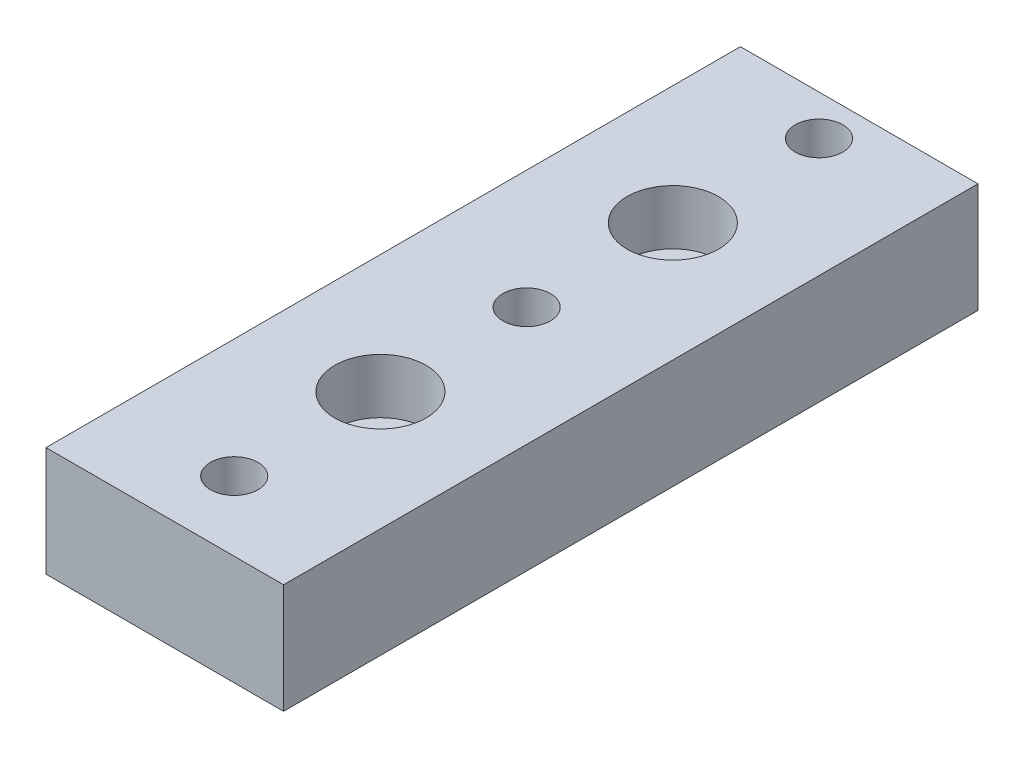
ISO-10303-21;
HEADER;
FILE_DESCRIPTION(('STEP AP214'),'2;1');
FILE_NAME('part.step','',(''),(''),'','','');
FILE_SCHEMA(('AUTOMOTIVE_DESIGN { 1 0 10303 214 1 1 1 1 }'));
ENDSEC;
DATA;
#1=APPLICATION_CONTEXT('core data for automotive mechanical design processes');
#2=APPLICATION_PROTOCOL_DEFINITION('international standard','automotive_design',2000,#1);
#3=PRODUCT_CONTEXT('',#1,'mechanical');
#4=PRODUCT('Part','Part','',(#3));
#5=PRODUCT_RELATED_PRODUCT_CATEGORY('part','',(#4));
#6=PRODUCT_DEFINITION_FORMATION('','',#4);
#7=PRODUCT_DEFINITION_CONTEXT('part definition',#1,'design');
#8=PRODUCT_DEFINITION('design','',#6,#7);
#9=PRODUCT_DEFINITION_SHAPE('','',#8);
#10=(LENGTH_UNIT() NAMED_UNIT(*) SI_UNIT(.MILLI.,.METRE.));
#11=(NAMED_UNIT(*) PLANE_ANGLE_UNIT() SI_UNIT($,.RADIAN.));
#12=(NAMED_UNIT(*) SI_UNIT($,.STERADIAN.) SOLID_ANGLE_UNIT());
#13=UNCERTAINTY_MEASURE_WITH_UNIT(LENGTH_MEASURE(1.E-05),#10,'distance_accuracy_value','');
#14=(GEOMETRIC_REPRESENTATION_CONTEXT(3) GLOBAL_UNCERTAINTY_ASSIGNED_CONTEXT((#13)) GLOBAL_UNIT_ASSIGNED_CONTEXT((#10,
#11,#12)) REPRESENTATION_CONTEXT('',''));
#15=CARTESIAN_POINT('',(0.,0.,0.));
#16=DIRECTION('',(0.,0.,1.));
#17=DIRECTION('',(1.,0.,0.));
#18=AXIS2_PLACEMENT_3D('',#15,#16,#17);
#19=CARTESIAN_POINT('',(0.,-3.,-4.4));
#20=DIRECTION('',(0.,1.,0.));
#21=DIRECTION('',(0.,0.,1.));
#22=AXIS2_PLACEMENT_3D('',#19,#20,#21);
#23=CYLINDRICAL_SURFACE('',#22,0.65);
#24=CARTESIAN_POINT('',(0.,-3.,-4.4));
#25=DIRECTION('',(0.,1.,0.));
#26=DIRECTION('',(0.,0.,1.));
#27=AXIS2_PLACEMENT_3D('',#24,#25,#26);
#28=CIRCLE('',#27,0.65);
#29=CARTESIAN_POINT('',(0.,-3.,-3.75));
#30=VERTEX_POINT('',#29);
#31=EDGE_CURVE('E144',#30,#30,#28,.T.);
#32=ORIENTED_EDGE('',*,*,#31,.F.);
#33=EDGE_LOOP('',(#32));
#34=FACE_BOUND('',#33,.T.);
#35=CARTESIAN_POINT('',(0.,-1.5,-4.4));
#36=DIRECTION('',(0.,1.,0.));
#37=DIRECTION('',(0.,0.,1.));
#38=AXIS2_PLACEMENT_3D('',#35,#36,#37);
#39=CIRCLE('',#38,0.65);
#40=CARTESIAN_POINT('',(0.,-1.5,-3.75));
#41=VERTEX_POINT('',#40);
#42=EDGE_CURVE('E43',#41,#41,#39,.F.);
#43=ORIENTED_EDGE('',*,*,#42,.F.);
#44=EDGE_LOOP('',(#43));
#45=FACE_BOUND('',#44,.T.);
#46=ADVANCED_FACE('F39',(#34,#45),#23,.F.);
#47=CARTESIAN_POINT('',(0.,-3.,3.6));
#48=DIRECTION('',(0.,1.,0.));
#49=DIRECTION('',(0.,0.,1.));
#50=AXIS2_PLACEMENT_3D('',#47,#48,#49);
#51=CYLINDRICAL_SURFACE('',#50,0.65);
#52=CARTESIAN_POINT('',(0.,-3.,3.6));
#53=DIRECTION('',(0.,1.,0.));
#54=DIRECTION('',(0.,0.,1.));
#55=AXIS2_PLACEMENT_3D('',#52,#53,#54);
#56=CIRCLE('',#55,0.65);
#57=CARTESIAN_POINT('',(0.,-3.,4.25));
#58=VERTEX_POINT('',#57);
#59=EDGE_CURVE('E123',#58,#58,#56,.T.);
#60=ORIENTED_EDGE('',*,*,#59,.F.);
#61=EDGE_LOOP('',(#60));
#62=FACE_BOUND('',#61,.T.);
#63=CARTESIAN_POINT('',(0.,-1.5,3.6));
#64=DIRECTION('',(0.,1.,0.));
#65=DIRECTION('',(0.,0.,1.));
#66=AXIS2_PLACEMENT_3D('',#63,#64,#65);
#67=CIRCLE('',#66,0.65);
#68=CARTESIAN_POINT('',(0.,-1.5,4.25));
#69=VERTEX_POINT('',#68);
#70=EDGE_CURVE('E117',#69,#69,#67,.F.);
#71=ORIENTED_EDGE('',*,*,#70,.F.);
#72=EDGE_LOOP('',(#71));
#73=FACE_BOUND('',#72,.T.);
#74=ADVANCED_FACE('F185',(#62,#73),#51,.F.);
#75=CARTESIAN_POINT('',(-3.25,-3.,9.5));
#76=DIRECTION('',(0.,0.,1.));
#77=DIRECTION('',(1.,0.,0.));
#78=AXIS2_PLACEMENT_3D('',#75,#76,#77);
#79=PLANE('',#78);
#80=DIRECTION('',(1.,0.,0.));
#81=VECTOR('',#80,1.);
#82=CARTESIAN_POINT('',(-3.25,0.,9.5));
#83=LINE('',#82,#81);
#84=CARTESIAN_POINT('',(-3.25,0.,9.5));
#85=VERTEX_POINT('',#84);
#86=CARTESIAN_POINT('',(3.25,0.,9.5));
#87=VERTEX_POINT('',#86);
#88=EDGE_CURVE('E107',#85,#87,#83,.T.);
#89=ORIENTED_EDGE('',*,*,#88,.F.);
#90=DIRECTION('',(0.,1.,0.));
#91=VECTOR('',#90,1.);
#92=CARTESIAN_POINT('',(-3.25,-3.,9.5));
#93=LINE('',#92,#91);
#94=CARTESIAN_POINT('',(-3.25,-3.,9.5));
#95=VERTEX_POINT('',#94);
#96=EDGE_CURVE('E11',#95,#85,#93,.T.);
#97=ORIENTED_EDGE('',*,*,#96,.F.);
#98=DIRECTION('',(1.,0.,0.));
#99=VECTOR('',#98,1.);
#100=CARTESIAN_POINT('',(-3.25,-3.,9.5));
#101=LINE('',#100,#99);
#102=CARTESIAN_POINT('',(3.25,-3.,9.5));
#103=VERTEX_POINT('',#102);
#104=EDGE_CURVE('E100',#95,#103,#101,.T.);
#105=ORIENTED_EDGE('',*,*,#104,.T.);
#106=DIRECTION('',(0.,1.,0.));
#107=VECTOR('',#106,1.);
#108=CARTESIAN_POINT('',(3.25,-3.,9.5));
#109=LINE('',#108,#107);
#110=EDGE_CURVE('E83',#103,#87,#109,.T.);
#111=ORIENTED_EDGE('',*,*,#110,.T.);
#112=EDGE_LOOP('',(#89,#97,#105,#111));
#113=FACE_BOUND('',#112,.T.);
#114=ADVANCED_FACE('F41',(#113),#79,.T.);
#115=CARTESIAN_POINT('',(-3.25,-3.,9.5));
#116=DIRECTION('',(-1.,0.,0.));
#117=DIRECTION('',(0.,0.,1.));
#118=AXIS2_PLACEMENT_3D('',#115,#116,#117);
#119=PLANE('',#118);
#120=DIRECTION('',(0.,0.,1.));
#121=VECTOR('',#120,1.);
#122=CARTESIAN_POINT('',(-3.25,0.,9.5));
#123=LINE('',#122,#121);
#124=CARTESIAN_POINT('',(-3.25,0.,-9.5));
#125=VERTEX_POINT('',#124);
#126=EDGE_CURVE('E102',#125,#85,#123,.T.);
#127=ORIENTED_EDGE('',*,*,#126,.F.);
#128=DIRECTION('',(0.,1.,0.));
#129=VECTOR('',#128,1.);
#130=CARTESIAN_POINT('',(-3.25,-3.,-9.5));
#131=LINE('',#130,#129);
#132=CARTESIAN_POINT('',(-3.25,-3.,-9.5));
#133=VERTEX_POINT('',#132);
#134=EDGE_CURVE('E49',#133,#125,#131,.T.);
#135=ORIENTED_EDGE('',*,*,#134,.F.);
#136=DIRECTION('',(0.,0.,1.));
#137=VECTOR('',#136,1.);
#138=CARTESIAN_POINT('',(-3.25,-3.,9.5));
#139=LINE('',#138,#137);
#140=EDGE_CURVE('E97',#133,#95,#139,.T.);
#141=ORIENTED_EDGE('',*,*,#140,.T.);
#142=ORIENTED_EDGE('',*,*,#96,.T.);
#143=EDGE_LOOP('',(#127,#135,#141,#142));
#144=FACE_BOUND('',#143,.T.);
#145=ADVANCED_FACE('F177',(#144),#119,.T.);
#146=CARTESIAN_POINT('',(-3.25,-3.,-9.5));
#147=DIRECTION('',(0.,0.,-1.));
#148=DIRECTION('',(-1.,0.,0.));
#149=AXIS2_PLACEMENT_3D('',#146,#147,#148);
#150=PLANE('',#149);
#151=DIRECTION('',(-1.,0.,0.));
#152=VECTOR('',#151,1.);
#153=CARTESIAN_POINT('',(-3.25,0.,-9.5));
#154=LINE('',#153,#152);
#155=CARTESIAN_POINT('',(3.25,0.,-9.5));
#156=VERTEX_POINT('',#155);
#157=EDGE_CURVE('E91',#156,#125,#154,.T.);
#158=ORIENTED_EDGE('',*,*,#157,.F.);
#159=DIRECTION('',(0.,1.,0.));
#160=VECTOR('',#159,1.);
#161=CARTESIAN_POINT('',(3.25,-3.,-9.5));
#162=LINE('',#161,#160);
#163=CARTESIAN_POINT('',(3.25,-3.,-9.5));
#164=VERTEX_POINT('',#163);
#165=EDGE_CURVE('E86',#164,#156,#162,.T.);
#166=ORIENTED_EDGE('',*,*,#165,.F.);
#167=DIRECTION('',(-1.,0.,0.));
#168=VECTOR('',#167,1.);
#169=CARTESIAN_POINT('',(-3.25,-3.,-9.5));
#170=LINE('',#169,#168);
#171=EDGE_CURVE('E89',#164,#133,#170,.T.);
#172=ORIENTED_EDGE('',*,*,#171,.T.);
#173=ORIENTED_EDGE('',*,*,#134,.T.);
#174=EDGE_LOOP('',(#158,#166,#172,#173));
#175=FACE_BOUND('',#174,.T.);
#176=ADVANCED_FACE('F88',(#175),#150,.T.);
#177=CARTESIAN_POINT('',(3.25,-3.,9.5));
#178=DIRECTION('',(1.,0.,0.));
#179=DIRECTION('',(0.,0.,-1.));
#180=AXIS2_PLACEMENT_3D('',#177,#178,#179);
#181=PLANE('',#180);
#182=DIRECTION('',(0.,0.,-1.));
#183=VECTOR('',#182,1.);
#184=CARTESIAN_POINT('',(3.25,0.,9.5));
#185=LINE('',#184,#183);
#186=EDGE_CURVE('E110',#87,#156,#185,.T.);
#187=ORIENTED_EDGE('',*,*,#186,.F.);
#188=ORIENTED_EDGE('',*,*,#110,.F.);
#189=DIRECTION('',(0.,0.,-1.));
#190=VECTOR('',#189,1.);
#191=CARTESIAN_POINT('',(3.25,-3.,9.5));
#192=LINE('',#191,#190);
#193=EDGE_CURVE('E96',#103,#164,#192,.T.);
#194=ORIENTED_EDGE('',*,*,#193,.T.);
#195=ORIENTED_EDGE('',*,*,#165,.T.);
#196=EDGE_LOOP('',(#187,#188,#194,#195));
#197=FACE_BOUND('',#196,.T.);
#198=ADVANCED_FACE('F99',(#197),#181,.T.);
#199=CARTESIAN_POINT('',(0.,-3.,0.));
#200=DIRECTION('',(0.,1.,0.));
#201=DIRECTION('',(0.,0.,1.));
#202=AXIS2_PLACEMENT_3D('',#199,#200,#201);
#203=PLANE('',#202);
#204=CARTESIAN_POINT('',(0.,-3.,7.6));
#205=DIRECTION('',(0.,1.,0.));
#206=DIRECTION('',(0.,0.,1.));
#207=AXIS2_PLACEMENT_3D('',#204,#205,#206);
#208=CIRCLE('',#207,0.65);
#209=CARTESIAN_POINT('',(0.,-3.,8.25));
#210=VERTEX_POINT('',#209);
#211=EDGE_CURVE('E111',#210,#210,#208,.T.);
#212=ORIENTED_EDGE('',*,*,#211,.T.);
#213=EDGE_LOOP('',(#212));
#214=FACE_BOUND('',#213,.T.);
#215=ORIENTED_EDGE('',*,*,#59,.T.);
#216=EDGE_LOOP('',(#215));
#217=FACE_BOUND('',#216,.T.);
#218=ORIENTED_EDGE('',*,*,#31,.T.);
#219=EDGE_LOOP('',(#218));
#220=FACE_BOUND('',#219,.T.);
#221=CARTESIAN_POINT('',(0.,-3.,-8.4));
#222=DIRECTION('',(0.,1.,0.));
#223=DIRECTION('',(0.,0.,1.));
#224=AXIS2_PLACEMENT_3D('',#221,#222,#223);
#225=CIRCLE('',#224,0.65);
#226=CARTESIAN_POINT('',(0.,-3.,-7.75));
#227=VERTEX_POINT('',#226);
#228=EDGE_CURVE('E147',#227,#227,#225,.T.);
#229=ORIENTED_EDGE('',*,*,#228,.T.);
#230=EDGE_LOOP('',(#229));
#231=FACE_BOUND('',#230,.T.);
#232=CARTESIAN_POINT('',(0.,-3.,-0.4));
#233=DIRECTION('',(0.,1.,0.));
#234=DIRECTION('',(0.,0.,1.));
#235=AXIS2_PLACEMENT_3D('',#232,#233,#234);
#236=CIRCLE('',#235,0.65);
#237=CARTESIAN_POINT('',(0.,-3.,0.25));
#238=VERTEX_POINT('',#237);
#239=EDGE_CURVE('E152',#238,#238,#236,.T.);
#240=ORIENTED_EDGE('',*,*,#239,.T.);
#241=EDGE_LOOP('',(#240));
#242=FACE_BOUND('',#241,.T.);
#243=ORIENTED_EDGE('',*,*,#104,.F.);
#244=ORIENTED_EDGE('',*,*,#140,.F.);
#245=ORIENTED_EDGE('',*,*,#171,.F.);
#246=ORIENTED_EDGE('',*,*,#193,.F.);
#247=EDGE_LOOP('',(#243,#244,#245,#246));
#248=FACE_BOUND('',#247,.T.);
#249=ADVANCED_FACE('F95',(#214,#217,#220,#231,#242,#248),#203,.F.);
#250=CARTESIAN_POINT('',(0.,0.,0.));
#251=DIRECTION('',(0.,1.,0.));
#252=DIRECTION('',(0.,0.,1.));
#253=AXIS2_PLACEMENT_3D('',#250,#251,#252);
#254=PLANE('',#253);
#255=CARTESIAN_POINT('',(0.,0.,-4.4));
#256=DIRECTION('',(0.,1.,0.));
#257=DIRECTION('',(0.,0.,1.));
#258=AXIS2_PLACEMENT_3D('',#255,#256,#257);
#259=CIRCLE('',#258,1.25);
#260=CARTESIAN_POINT('',(0.,0.,-3.15));
#261=VERTEX_POINT('',#260);
#262=EDGE_CURVE('E125',#261,#261,#259,.T.);
#263=ORIENTED_EDGE('',*,*,#262,.F.);
#264=EDGE_LOOP('',(#263));
#265=FACE_BOUND('',#264,.T.);
#266=CARTESIAN_POINT('',(0.,0.,3.6));
#267=DIRECTION('',(0.,1.,0.));
#268=DIRECTION('',(0.,0.,1.));
#269=AXIS2_PLACEMENT_3D('',#266,#267,#268);
#270=CIRCLE('',#269,1.25);
#271=CARTESIAN_POINT('',(0.,0.,4.85));
#272=VERTEX_POINT('',#271);
#273=EDGE_CURVE('E130',#272,#272,#270,.T.);
#274=ORIENTED_EDGE('',*,*,#273,.F.);
#275=EDGE_LOOP('',(#274));
#276=FACE_BOUND('',#275,.T.);
#277=CARTESIAN_POINT('',(0.,0.,7.6));
#278=DIRECTION('',(0.,1.,0.));
#279=DIRECTION('',(0.,0.,1.));
#280=AXIS2_PLACEMENT_3D('',#277,#278,#279);
#281=CIRCLE('',#280,0.65);
#282=CARTESIAN_POINT('',(0.,0.,8.25));
#283=VERTEX_POINT('',#282);
#284=EDGE_CURVE('E140',#283,#283,#281,.T.);
#285=ORIENTED_EDGE('',*,*,#284,.F.);
#286=EDGE_LOOP('',(#285));
#287=FACE_BOUND('',#286,.T.);
#288=CARTESIAN_POINT('',(0.,0.,-8.4));
#289=DIRECTION('',(0.,1.,0.));
#290=DIRECTION('',(0.,0.,1.));
#291=AXIS2_PLACEMENT_3D('',#288,#289,#290);
#292=CIRCLE('',#291,0.65);
#293=CARTESIAN_POINT('',(0.,0.,-7.75));
#294=VERTEX_POINT('',#293);
#295=EDGE_CURVE('E155',#294,#294,#292,.T.);
#296=ORIENTED_EDGE('',*,*,#295,.F.);
#297=EDGE_LOOP('',(#296));
#298=FACE_BOUND('',#297,.T.);
#299=CARTESIAN_POINT('',(0.,0.,-0.4));
#300=DIRECTION('',(0.,1.,0.));
#301=DIRECTION('',(0.,0.,1.));
#302=AXIS2_PLACEMENT_3D('',#299,#300,#301);
#303=CIRCLE('',#302,0.65);
#304=CARTESIAN_POINT('',(0.,0.,0.25));
#305=VERTEX_POINT('',#304);
#306=EDGE_CURVE('E143',#305,#305,#303,.T.);
#307=ORIENTED_EDGE('',*,*,#306,.F.);
#308=EDGE_LOOP('',(#307));
#309=FACE_BOUND('',#308,.T.);
#310=ORIENTED_EDGE('',*,*,#88,.T.);
#311=ORIENTED_EDGE('',*,*,#186,.T.);
#312=ORIENTED_EDGE('',*,*,#157,.T.);
#313=ORIENTED_EDGE('',*,*,#126,.T.);
#314=EDGE_LOOP('',(#310,#311,#312,#313));
#315=FACE_BOUND('',#314,.T.);
#316=ADVANCED_FACE('F170',(#265,#276,#287,#298,#309,#315),#254,.T.);
#317=CARTESIAN_POINT('',(0.,-3.,-0.4));
#318=DIRECTION('',(0.,1.,0.));
#319=DIRECTION('',(0.,0.,1.));
#320=AXIS2_PLACEMENT_3D('',#317,#318,#319);
#321=CYLINDRICAL_SURFACE('',#320,0.65);
#322=ORIENTED_EDGE('',*,*,#239,.F.);
#323=EDGE_LOOP('',(#322));
#324=FACE_BOUND('',#323,.T.);
#325=ORIENTED_EDGE('',*,*,#306,.T.);
#326=EDGE_LOOP('',(#325));
#327=FACE_BOUND('',#326,.T.);
#328=ADVANCED_FACE('F166',(#324,#327),#321,.F.);
#329=CARTESIAN_POINT('',(0.,-3.,-8.4));
#330=DIRECTION('',(0.,1.,0.));
#331=DIRECTION('',(0.,0.,1.));
#332=AXIS2_PLACEMENT_3D('',#329,#330,#331);
#333=CYLINDRICAL_SURFACE('',#332,0.65);
#334=ORIENTED_EDGE('',*,*,#228,.F.);
#335=EDGE_LOOP('',(#334));
#336=FACE_BOUND('',#335,.T.);
#337=ORIENTED_EDGE('',*,*,#295,.T.);
#338=EDGE_LOOP('',(#337));
#339=FACE_BOUND('',#338,.T.);
#340=ADVANCED_FACE('F162',(#336,#339),#333,.F.);
#341=CARTESIAN_POINT('',(0.,-3.,7.6));
#342=DIRECTION('',(0.,1.,0.));
#343=DIRECTION('',(0.,0.,1.));
#344=AXIS2_PLACEMENT_3D('',#341,#342,#343);
#345=CYLINDRICAL_SURFACE('',#344,0.65);
#346=ORIENTED_EDGE('',*,*,#211,.F.);
#347=EDGE_LOOP('',(#346));
#348=FACE_BOUND('',#347,.T.);
#349=ORIENTED_EDGE('',*,*,#284,.T.);
#350=EDGE_LOOP('',(#349));
#351=FACE_BOUND('',#350,.T.);
#352=ADVANCED_FACE('F165',(#348,#351),#345,.F.);
#353=CARTESIAN_POINT('',(0.,-1.5,3.6));
#354=DIRECTION('',(0.,1.,0.));
#355=DIRECTION('',(0.,0.,1.));
#356=AXIS2_PLACEMENT_3D('',#353,#354,#355);
#357=PLANE('',#356);
#358=CARTESIAN_POINT('',(0.,-1.5,3.6));
#359=DIRECTION('',(0.,1.,0.));
#360=DIRECTION('',(0.,0.,1.));
#361=AXIS2_PLACEMENT_3D('',#358,#359,#360);
#362=CIRCLE('',#361,1.25);
#363=CARTESIAN_POINT('',(0.,-1.5,4.85));
#364=VERTEX_POINT('',#363);
#365=EDGE_CURVE('E135',#364,#364,#362,.T.);
#366=ORIENTED_EDGE('',*,*,#365,.T.);
#367=EDGE_LOOP('',(#366));
#368=FACE_BOUND('',#367,.T.);
#369=ORIENTED_EDGE('',*,*,#70,.T.);
#370=EDGE_LOOP('',(#369));
#371=FACE_BOUND('',#370,.T.);
#372=ADVANCED_FACE('F215',(#368,#371),#357,.T.);
#373=CARTESIAN_POINT('',(0.,-1.5,3.6));
#374=DIRECTION('',(0.,1.,0.));
#375=DIRECTION('',(0.,0.,1.));
#376=AXIS2_PLACEMENT_3D('',#373,#374,#375);
#377=CYLINDRICAL_SURFACE('',#376,1.25);
#378=ORIENTED_EDGE('',*,*,#365,.F.);
#379=EDGE_LOOP('',(#378));
#380=FACE_BOUND('',#379,.T.);
#381=ORIENTED_EDGE('',*,*,#273,.T.);
#382=EDGE_LOOP('',(#381));
#383=FACE_BOUND('',#382,.T.);
#384=ADVANCED_FACE('F221',(#380,#383),#377,.F.);
#385=CARTESIAN_POINT('',(0.,-1.5,-4.4));
#386=DIRECTION('',(0.,1.,0.));
#387=DIRECTION('',(0.,0.,1.));
#388=AXIS2_PLACEMENT_3D('',#385,#386,#387);
#389=PLANE('',#388);
#390=CARTESIAN_POINT('',(0.,-1.5,-4.4));
#391=DIRECTION('',(0.,1.,0.));
#392=DIRECTION('',(0.,0.,1.));
#393=AXIS2_PLACEMENT_3D('',#390,#391,#392);
#394=CIRCLE('',#393,1.25);
#395=CARTESIAN_POINT('',(0.,-1.5,-3.15));
#396=VERTEX_POINT('',#395);
#397=EDGE_CURVE('E119',#396,#396,#394,.T.);
#398=ORIENTED_EDGE('',*,*,#397,.T.);
#399=EDGE_LOOP('',(#398));
#400=FACE_BOUND('',#399,.T.);
#401=ORIENTED_EDGE('',*,*,#42,.T.);
#402=EDGE_LOOP('',(#401));
#403=FACE_BOUND('',#402,.T.);
#404=ADVANCED_FACE('F226',(#400,#403),#389,.T.);
#405=CARTESIAN_POINT('',(0.,-1.5,-4.4));
#406=DIRECTION('',(0.,1.,0.));
#407=DIRECTION('',(0.,0.,1.));
#408=AXIS2_PLACEMENT_3D('',#405,#406,#407);
#409=CYLINDRICAL_SURFACE('',#408,1.25);
#410=ORIENTED_EDGE('',*,*,#397,.F.);
#411=EDGE_LOOP('',(#410));
#412=FACE_BOUND('',#411,.T.);
#413=ORIENTED_EDGE('',*,*,#262,.T.);
#414=EDGE_LOOP('',(#413));
#415=FACE_BOUND('',#414,.T.);
#416=ADVANCED_FACE('F230',(#412,#415),#409,.F.);
#417=CLOSED_SHELL('',(#46,#74,#114,#145,#176,#198,#249,#316,#328,#340,#352,#372,#384,#404,#416));
#418=MANIFOLD_SOLID_BREP('B2',#417);
#419=ADVANCED_BREP_SHAPE_REPRESENTATION('',(#18,#418),#14);
#420=SHAPE_DEFINITION_REPRESENTATION(#9,#419);
ENDSEC;
END-ISO-10303-21;
